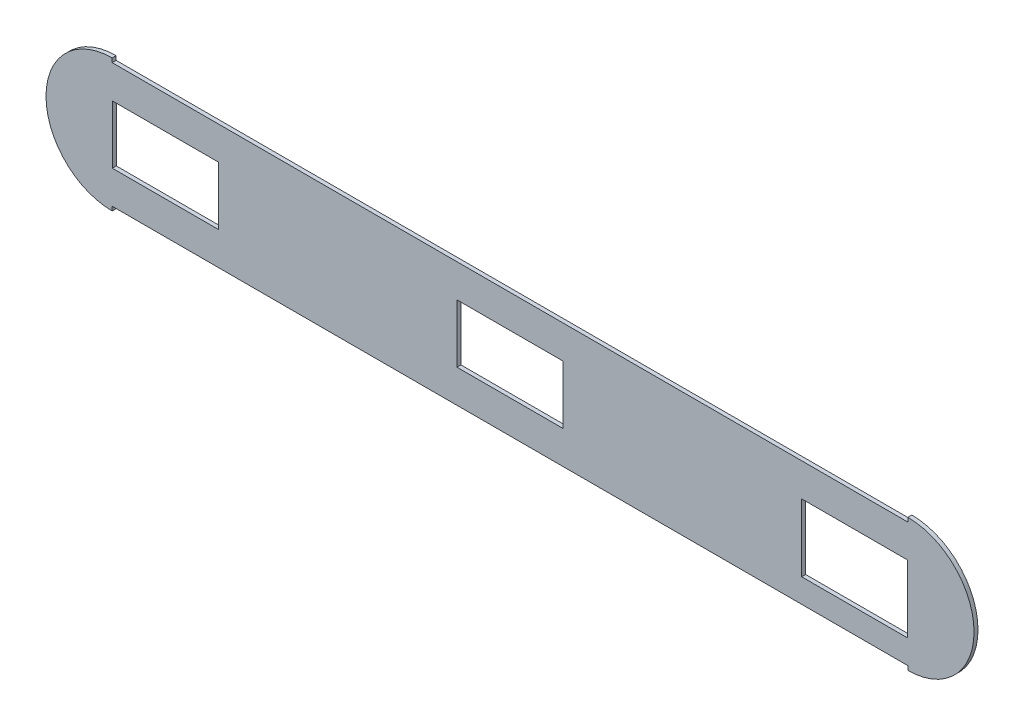
ISO-10303-21;
HEADER;
FILE_DESCRIPTION(('STEP AP214'),'2;1');
FILE_NAME('part.step','',(''),(''),'','','');
FILE_SCHEMA(('AUTOMOTIVE_DESIGN { 1 0 10303 214 1 1 1 1 }'));
ENDSEC;
DATA;
#1=APPLICATION_CONTEXT('core data for automotive mechanical design processes');
#2=APPLICATION_PROTOCOL_DEFINITION('international standard','automotive_design',2000,#1);
#3=PRODUCT_CONTEXT('',#1,'mechanical');
#4=PRODUCT('Part','Part','',(#3));
#5=PRODUCT_RELATED_PRODUCT_CATEGORY('part','',(#4));
#6=PRODUCT_DEFINITION_FORMATION('','',#4);
#7=PRODUCT_DEFINITION_CONTEXT('part definition',#1,'design');
#8=PRODUCT_DEFINITION('design','',#6,#7);
#9=PRODUCT_DEFINITION_SHAPE('','',#8);
#10=(LENGTH_UNIT() NAMED_UNIT(*) SI_UNIT(.MILLI.,.METRE.));
#11=(NAMED_UNIT(*) PLANE_ANGLE_UNIT() SI_UNIT($,.RADIAN.));
#12=(NAMED_UNIT(*) SI_UNIT($,.STERADIAN.) SOLID_ANGLE_UNIT());
#13=UNCERTAINTY_MEASURE_WITH_UNIT(LENGTH_MEASURE(1.E-05),#10,'distance_accuracy_value','');
#14=(GEOMETRIC_REPRESENTATION_CONTEXT(3) GLOBAL_UNCERTAINTY_ASSIGNED_CONTEXT((#13)) GLOBAL_UNIT_ASSIGNED_CONTEXT((#10,
#11,#12)) REPRESENTATION_CONTEXT('',''));
#15=CARTESIAN_POINT('',(0.,0.,0.));
#16=DIRECTION('',(0.,0.,1.));
#17=DIRECTION('',(1.,0.,0.));
#18=AXIS2_PLACEMENT_3D('',#15,#16,#17);
#19=CARTESIAN_POINT('',(-300.,0.,0.));
#20=DIRECTION('',(0.,0.,1.));
#21=DIRECTION('',(1.,0.,0.));
#22=AXIS2_PLACEMENT_3D('',#19,#20,#21);
#23=PLANE('',#22);
#24=DIRECTION('',(1.,0.,0.));
#25=VECTOR('',#24,1.);
#26=CARTESIAN_POINT('',(-300.,-28.9008568911611,0.));
#27=LINE('',#26,#25);
#28=CARTESIAN_POINT('',(220.,-28.900856891161,0.));
#29=VERTEX_POINT('',#28);
#30=CARTESIAN_POINT('',(300.,-28.900856891161,0.));
#31=VERTEX_POINT('',#30);
#32=EDGE_CURVE('E270',#29,#31,#27,.T.);
#33=ORIENTED_EDGE('',*,*,#32,.T.);
#34=DIRECTION('',(0.,1.,0.));
#35=VECTOR('',#34,1.);
#36=CARTESIAN_POINT('',(300.,0.,0.));
#37=LINE('',#36,#35);
#38=CARTESIAN_POINT('',(300.,22.,0.));
#39=VERTEX_POINT('',#38);
#40=EDGE_CURVE('E279',#31,#39,#37,.T.);
#41=ORIENTED_EDGE('',*,*,#40,.T.);
#42=DIRECTION('',(-1.,0.,0.));
#43=VECTOR('',#42,1.);
#44=CARTESIAN_POINT('',(-300.,22.,0.));
#45=LINE('',#44,#43);
#46=CARTESIAN_POINT('',(220.,22.,0.));
#47=VERTEX_POINT('',#46);
#48=EDGE_CURVE('E276',#39,#47,#45,.T.);
#49=ORIENTED_EDGE('',*,*,#48,.T.);
#50=DIRECTION('',(0.,-1.,0.));
#51=VECTOR('',#50,1.);
#52=CARTESIAN_POINT('',(220.,0.,0.));
#53=LINE('',#52,#51);
#54=EDGE_CURVE('E273',#47,#29,#53,.T.);
#55=ORIENTED_EDGE('',*,*,#54,.T.);
#56=EDGE_LOOP('',(#33,#41,#49,#55));
#57=FACE_BOUND('',#56,.T.);
#58=DIRECTION('',(-1.,0.,0.));
#59=VECTOR('',#58,1.);
#60=CARTESIAN_POINT('',(-300.,22.,0.));
#61=LINE('',#60,#59);
#62=CARTESIAN_POINT('',(-220.,22.,0.));
#63=VERTEX_POINT('',#62);
#64=CARTESIAN_POINT('',(-300.,22.,0.));
#65=VERTEX_POINT('',#64);
#66=EDGE_CURVE('E258',#63,#65,#61,.T.);
#67=ORIENTED_EDGE('',*,*,#66,.T.);
#68=DIRECTION('',(0.,-1.,0.));
#69=VECTOR('',#68,1.);
#70=CARTESIAN_POINT('',(-300.,0.,0.));
#71=LINE('',#70,#69);
#72=CARTESIAN_POINT('',(-300.,-22.,0.));
#73=VERTEX_POINT('',#72);
#74=EDGE_CURVE('E267',#65,#73,#71,.T.);
#75=ORIENTED_EDGE('',*,*,#74,.T.);
#76=DIRECTION('',(1.,0.,0.));
#77=VECTOR('',#76,1.);
#78=CARTESIAN_POINT('',(-300.,-22.,0.));
#79=LINE('',#78,#77);
#80=CARTESIAN_POINT('',(-220.,-22.0000000000001,0.));
#81=VERTEX_POINT('',#80);
#82=EDGE_CURVE('E264',#73,#81,#79,.T.);
#83=ORIENTED_EDGE('',*,*,#82,.T.);
#84=DIRECTION('',(0.,1.,0.));
#85=VECTOR('',#84,1.);
#86=CARTESIAN_POINT('',(-220.,0.,0.));
#87=LINE('',#86,#85);
#88=EDGE_CURVE('E261',#81,#63,#87,.T.);
#89=ORIENTED_EDGE('',*,*,#88,.T.);
#90=EDGE_LOOP('',(#67,#75,#83,#89));
#91=FACE_BOUND('',#90,.T.);
#92=DIRECTION('',(1.,0.,0.));
#93=VECTOR('',#92,1.);
#94=CARTESIAN_POINT('',(-300.,-22.,0.));
#95=LINE('',#94,#93);
#96=CARTESIAN_POINT('',(-40.0000000000001,-22.,0.));
#97=VERTEX_POINT('',#96);
#98=CARTESIAN_POINT('',(39.9999999999999,-22.,0.));
#99=VERTEX_POINT('',#98);
#100=EDGE_CURVE('E217',#97,#99,#95,.T.);
#101=ORIENTED_EDGE('',*,*,#100,.T.);
#102=DIRECTION('',(0.,1.,0.));
#103=VECTOR('',#102,1.);
#104=CARTESIAN_POINT('',(39.9999999999999,0.,0.));
#105=LINE('',#104,#103);
#106=CARTESIAN_POINT('',(39.9999999999999,22.,0.));
#107=VERTEX_POINT('',#106);
#108=EDGE_CURVE('E255',#99,#107,#105,.T.);
#109=ORIENTED_EDGE('',*,*,#108,.T.);
#110=DIRECTION('',(-1.,0.,0.));
#111=VECTOR('',#110,1.);
#112=CARTESIAN_POINT('',(-300.,22.,0.));
#113=LINE('',#112,#111);
#114=CARTESIAN_POINT('',(-40.0000000000001,22.,0.));
#115=VERTEX_POINT('',#114);
#116=EDGE_CURVE('E252',#107,#115,#113,.T.);
#117=ORIENTED_EDGE('',*,*,#116,.T.);
#118=DIRECTION('',(0.,-1.,0.));
#119=VECTOR('',#118,1.);
#120=CARTESIAN_POINT('',(-40.0000000000001,0.,0.));
#121=LINE('',#120,#119);
#122=EDGE_CURVE('E249',#115,#97,#121,.T.);
#123=ORIENTED_EDGE('',*,*,#122,.T.);
#124=EDGE_LOOP('',(#101,#109,#117,#123));
#125=FACE_BOUND('',#124,.T.);
#126=CARTESIAN_POINT('',(300.,0.,0.));
#127=DIRECTION('',(0.,0.,1.));
#128=DIRECTION('',(1.,0.,0.));
#129=AXIS2_PLACEMENT_3D('',#126,#127,#128);
#130=CIRCLE('',#129,50.);
#131=CARTESIAN_POINT('',(300.1,-49.9998999999,0.));
#132=VERTEX_POINT('',#131);
#133=CARTESIAN_POINT('',(300.1,49.9998999999,0.));
#134=VERTEX_POINT('',#133);
#135=EDGE_CURVE('E283',#132,#134,#130,.T.);
#136=ORIENTED_EDGE('',*,*,#135,.F.);
#137=DIRECTION('',(0.,1.,0.));
#138=VECTOR('',#137,1.);
#139=CARTESIAN_POINT('',(300.099999999999,1.04100755793368E-11,0.));
#140=LINE('',#139,#138);
#141=CARTESIAN_POINT('',(300.1,-46.9,0.));
#142=VERTEX_POINT('',#141);
#143=EDGE_CURVE('E46',#132,#142,#140,.T.);
#144=ORIENTED_EDGE('',*,*,#143,.T.);
#145=DIRECTION('',(-1.,0.,0.));
#146=VECTOR('',#145,1.);
#147=CARTESIAN_POINT('',(-300.,-46.9,0.));
#148=LINE('',#147,#146);
#149=CARTESIAN_POINT('',(-300.1,-46.9,0.));
#150=VERTEX_POINT('',#149);
#151=EDGE_CURVE('E210',#142,#150,#148,.T.);
#152=ORIENTED_EDGE('',*,*,#151,.T.);
#153=DIRECTION('',(0.,-1.,0.));
#154=VECTOR('',#153,1.);
#155=CARTESIAN_POINT('',(-300.1,0.,0.));
#156=LINE('',#155,#154);
#157=CARTESIAN_POINT('',(-300.1,-49.9998999999,0.));
#158=VERTEX_POINT('',#157);
#159=EDGE_CURVE('E205',#150,#158,#156,.T.);
#160=ORIENTED_EDGE('',*,*,#159,.T.);
#161=CARTESIAN_POINT('',(-300.,0.,0.));
#162=DIRECTION('',(0.,0.,1.));
#163=DIRECTION('',(1.,0.,0.));
#164=AXIS2_PLACEMENT_3D('',#161,#162,#163);
#165=CIRCLE('',#164,50.);
#166=CARTESIAN_POINT('',(-300.1,49.9998999999,0.));
#167=VERTEX_POINT('',#166);
#168=EDGE_CURVE('E287',#167,#158,#165,.T.);
#169=ORIENTED_EDGE('',*,*,#168,.F.);
#170=DIRECTION('',(0.,-1.,0.));
#171=VECTOR('',#170,1.);
#172=CARTESIAN_POINT('',(-300.1,0.,0.));
#173=LINE('',#172,#171);
#174=CARTESIAN_POINT('',(-300.1,46.9,0.));
#175=VERTEX_POINT('',#174);
#176=EDGE_CURVE('E200',#167,#175,#173,.T.);
#177=ORIENTED_EDGE('',*,*,#176,.T.);
#178=DIRECTION('',(1.,0.,0.));
#179=VECTOR('',#178,1.);
#180=CARTESIAN_POINT('',(-300.,46.9,0.));
#181=LINE('',#180,#179);
#182=CARTESIAN_POINT('',(300.1,46.9,0.));
#183=VERTEX_POINT('',#182);
#184=EDGE_CURVE('E208',#175,#183,#181,.T.);
#185=ORIENTED_EDGE('',*,*,#184,.T.);
#186=DIRECTION('',(0.,1.,0.));
#187=VECTOR('',#186,1.);
#188=CARTESIAN_POINT('',(300.100000000001,1.04100755793368E-11,0.));
#189=LINE('',#188,#187);
#190=EDGE_CURVE('E180',#183,#134,#189,.T.);
#191=ORIENTED_EDGE('',*,*,#190,.T.);
#192=EDGE_LOOP('',(#136,#144,#152,#160,#169,#177,#185,#191));
#193=FACE_BOUND('',#192,.T.);
#194=ADVANCED_FACE('F32',(#57,#91,#125,#193),#23,.F.);
#195=CARTESIAN_POINT('',(-300.,0.,3.));
#196=DIRECTION('',(0.,0.,1.));
#197=DIRECTION('',(1.,0.,0.));
#198=AXIS2_PLACEMENT_3D('',#195,#196,#197);
#199=PLANE('',#198);
#200=DIRECTION('',(0.,1.,0.));
#201=VECTOR('',#200,1.);
#202=CARTESIAN_POINT('',(300.099999999999,1.04100755793368E-11,3.));
#203=LINE('',#202,#201);
#204=CARTESIAN_POINT('',(300.1,-49.9998999999,3.));
#205=VERTEX_POINT('',#204);
#206=CARTESIAN_POINT('',(300.1,-46.9,3.));
#207=VERTEX_POINT('',#206);
#208=EDGE_CURVE('E191',#205,#207,#203,.T.);
#209=ORIENTED_EDGE('',*,*,#208,.F.);
#210=CARTESIAN_POINT('',(300.,0.,3.));
#211=DIRECTION('',(0.,0.,1.));
#212=DIRECTION('',(1.,0.,0.));
#213=AXIS2_PLACEMENT_3D('',#210,#211,#212);
#214=CIRCLE('',#213,50.);
#215=CARTESIAN_POINT('',(300.1,49.9998999999,3.));
#216=VERTEX_POINT('',#215);
#217=EDGE_CURVE('E188',#205,#216,#214,.T.);
#218=ORIENTED_EDGE('',*,*,#217,.T.);
#219=DIRECTION('',(0.,1.,0.));
#220=VECTOR('',#219,1.);
#221=CARTESIAN_POINT('',(300.100000000001,1.04100755793368E-11,3.));
#222=LINE('',#221,#220);
#223=CARTESIAN_POINT('',(300.1,46.9,3.));
#224=VERTEX_POINT('',#223);
#225=EDGE_CURVE('E54',#224,#216,#222,.T.);
#226=ORIENTED_EDGE('',*,*,#225,.F.);
#227=DIRECTION('',(1.,0.,0.));
#228=VECTOR('',#227,1.);
#229=CARTESIAN_POINT('',(-300.,46.9,3.));
#230=LINE('',#229,#228);
#231=CARTESIAN_POINT('',(-300.1,46.9,3.));
#232=VERTEX_POINT('',#231);
#233=EDGE_CURVE('E39',#232,#224,#230,.T.);
#234=ORIENTED_EDGE('',*,*,#233,.F.);
#235=DIRECTION('',(0.,-1.,0.));
#236=VECTOR('',#235,1.);
#237=CARTESIAN_POINT('',(-300.1,0.,3.));
#238=LINE('',#237,#236);
#239=CARTESIAN_POINT('',(-300.1,49.9998999999,3.));
#240=VERTEX_POINT('',#239);
#241=EDGE_CURVE('E198',#240,#232,#238,.T.);
#242=ORIENTED_EDGE('',*,*,#241,.F.);
#243=CARTESIAN_POINT('',(-300.,0.,3.));
#244=DIRECTION('',(0.,0.,1.));
#245=DIRECTION('',(1.,0.,0.));
#246=AXIS2_PLACEMENT_3D('',#243,#244,#245);
#247=CIRCLE('',#246,50.);
#248=CARTESIAN_POINT('',(-300.1,-49.9998999999,3.));
#249=VERTEX_POINT('',#248);
#250=EDGE_CURVE('E286',#240,#249,#247,.T.);
#251=ORIENTED_EDGE('',*,*,#250,.T.);
#252=DIRECTION('',(0.,-1.,0.));
#253=VECTOR('',#252,1.);
#254=CARTESIAN_POINT('',(-300.1,0.,3.));
#255=LINE('',#254,#253);
#256=CARTESIAN_POINT('',(-300.1,-46.9,3.));
#257=VERTEX_POINT('',#256);
#258=EDGE_CURVE('E203',#257,#249,#255,.T.);
#259=ORIENTED_EDGE('',*,*,#258,.F.);
#260=DIRECTION('',(-1.,0.,0.));
#261=VECTOR('',#260,1.);
#262=CARTESIAN_POINT('',(-300.,-46.9,3.));
#263=LINE('',#262,#261);
#264=EDGE_CURVE('E11',#207,#257,#263,.T.);
#265=ORIENTED_EDGE('',*,*,#264,.F.);
#266=EDGE_LOOP('',(#209,#218,#226,#234,#242,#251,#259,#265));
#267=FACE_BOUND('',#266,.T.);
#268=DIRECTION('',(0.,1.,0.));
#269=VECTOR('',#268,1.);
#270=CARTESIAN_POINT('',(300.,0.,3.));
#271=LINE('',#270,#269);
#272=CARTESIAN_POINT('',(300.,-28.900856891161,3.));
#273=VERTEX_POINT('',#272);
#274=CARTESIAN_POINT('',(300.,22.,3.));
#275=VERTEX_POINT('',#274);
#276=EDGE_CURVE('E317',#273,#275,#271,.T.);
#277=ORIENTED_EDGE('',*,*,#276,.F.);
#278=DIRECTION('',(1.,0.,0.));
#279=VECTOR('',#278,1.);
#280=CARTESIAN_POINT('',(-300.,-28.9008568911611,3.));
#281=LINE('',#280,#279);
#282=CARTESIAN_POINT('',(220.,-28.900856891161,3.));
#283=VERTEX_POINT('',#282);
#284=EDGE_CURVE('E310',#283,#273,#281,.T.);
#285=ORIENTED_EDGE('',*,*,#284,.F.);
#286=DIRECTION('',(0.,-1.,0.));
#287=VECTOR('',#286,1.);
#288=CARTESIAN_POINT('',(220.,0.,3.));
#289=LINE('',#288,#287);
#290=CARTESIAN_POINT('',(220.,22.,3.));
#291=VERTEX_POINT('',#290);
#292=EDGE_CURVE('E312',#291,#283,#289,.T.);
#293=ORIENTED_EDGE('',*,*,#292,.F.);
#294=DIRECTION('',(-1.,0.,0.));
#295=VECTOR('',#294,1.);
#296=CARTESIAN_POINT('',(-300.,22.,3.));
#297=LINE('',#296,#295);
#298=EDGE_CURVE('E315',#275,#291,#297,.T.);
#299=ORIENTED_EDGE('',*,*,#298,.F.);
#300=EDGE_LOOP('',(#277,#285,#293,#299));
#301=FACE_BOUND('',#300,.T.);
#302=DIRECTION('',(0.,-1.,0.));
#303=VECTOR('',#302,1.);
#304=CARTESIAN_POINT('',(-300.,0.,3.));
#305=LINE('',#304,#303);
#306=CARTESIAN_POINT('',(-300.,22.,3.));
#307=VERTEX_POINT('',#306);
#308=CARTESIAN_POINT('',(-300.,-22.,3.));
#309=VERTEX_POINT('',#308);
#310=EDGE_CURVE('E308',#307,#309,#305,.T.);
#311=ORIENTED_EDGE('',*,*,#310,.F.);
#312=DIRECTION('',(-1.,0.,0.));
#313=VECTOR('',#312,1.);
#314=CARTESIAN_POINT('',(-300.,22.,3.));
#315=LINE('',#314,#313);
#316=CARTESIAN_POINT('',(-220.,22.,3.));
#317=VERTEX_POINT('',#316);
#318=EDGE_CURVE('E301',#317,#307,#315,.T.);
#319=ORIENTED_EDGE('',*,*,#318,.F.);
#320=DIRECTION('',(0.,1.,0.));
#321=VECTOR('',#320,1.);
#322=CARTESIAN_POINT('',(-220.,0.,3.));
#323=LINE('',#322,#321);
#324=CARTESIAN_POINT('',(-220.,-22.0000000000001,3.));
#325=VERTEX_POINT('',#324);
#326=EDGE_CURVE('E303',#325,#317,#323,.T.);
#327=ORIENTED_EDGE('',*,*,#326,.F.);
#328=DIRECTION('',(1.,0.,0.));
#329=VECTOR('',#328,1.);
#330=CARTESIAN_POINT('',(-300.,-22.,3.));
#331=LINE('',#330,#329);
#332=EDGE_CURVE('E306',#309,#325,#331,.T.);
#333=ORIENTED_EDGE('',*,*,#332,.F.);
#334=EDGE_LOOP('',(#311,#319,#327,#333));
#335=FACE_BOUND('',#334,.T.);
#336=DIRECTION('',(0.,1.,0.));
#337=VECTOR('',#336,1.);
#338=CARTESIAN_POINT('',(39.9999999999999,0.,3.));
#339=LINE('',#338,#337);
#340=CARTESIAN_POINT('',(39.9999999999999,-22.,3.));
#341=VERTEX_POINT('',#340);
#342=CARTESIAN_POINT('',(39.9999999999999,22.,3.));
#343=VERTEX_POINT('',#342);
#344=EDGE_CURVE('E299',#341,#343,#339,.T.);
#345=ORIENTED_EDGE('',*,*,#344,.F.);
#346=DIRECTION('',(1.,0.,0.));
#347=VECTOR('',#346,1.);
#348=CARTESIAN_POINT('',(-300.,-22.,3.));
#349=LINE('',#348,#347);
#350=CARTESIAN_POINT('',(-40.0000000000001,-22.,3.));
#351=VERTEX_POINT('',#350);
#352=EDGE_CURVE('E290',#351,#341,#349,.T.);
#353=ORIENTED_EDGE('',*,*,#352,.F.);
#354=DIRECTION('',(0.,-1.,0.));
#355=VECTOR('',#354,1.);
#356=CARTESIAN_POINT('',(-40.0000000000001,0.,3.));
#357=LINE('',#356,#355);
#358=CARTESIAN_POINT('',(-40.0000000000001,22.,3.));
#359=VERTEX_POINT('',#358);
#360=EDGE_CURVE('E294',#359,#351,#357,.T.);
#361=ORIENTED_EDGE('',*,*,#360,.F.);
#362=DIRECTION('',(-1.,0.,0.));
#363=VECTOR('',#362,1.);
#364=CARTESIAN_POINT('',(-300.,22.,3.));
#365=LINE('',#364,#363);
#366=EDGE_CURVE('E297',#343,#359,#365,.T.);
#367=ORIENTED_EDGE('',*,*,#366,.F.);
#368=EDGE_LOOP('',(#345,#353,#361,#367));
#369=FACE_BOUND('',#368,.T.);
#370=ADVANCED_FACE('F185',(#267,#301,#335,#369),#199,.T.);
#371=CARTESIAN_POINT('',(-300.,0.,60.));
#372=DIRECTION('',(0.,0.,-1.));
#373=DIRECTION('',(-1.,0.,0.));
#374=AXIS2_PLACEMENT_3D('',#371,#372,#373);
#375=CYLINDRICAL_SURFACE('',#374,50.);
#376=ORIENTED_EDGE('',*,*,#168,.T.);
#377=DIRECTION('',(0.,0.,-1.));
#378=VECTOR('',#377,1.);
#379=CARTESIAN_POINT('',(-300.1,-49.9998999999,60.));
#380=LINE('',#379,#378);
#381=EDGE_CURVE('E177',#158,#249,#380,.F.);
#382=ORIENTED_EDGE('',*,*,#381,.T.);
#383=ORIENTED_EDGE('',*,*,#250,.F.);
#384=DIRECTION('',(0.,0.,-1.));
#385=VECTOR('',#384,1.);
#386=CARTESIAN_POINT('',(-300.1,49.9998999999,60.));
#387=LINE('',#386,#385);
#388=EDGE_CURVE('E323',#240,#167,#387,.T.);
#389=ORIENTED_EDGE('',*,*,#388,.T.);
#390=EDGE_LOOP('',(#376,#382,#383,#389));
#391=FACE_BOUND('',#390,.T.);
#392=ADVANCED_FACE('F329',(#391),#375,.T.);
#393=CARTESIAN_POINT('',(300.,0.,60.));
#394=DIRECTION('',(0.,0.,-1.));
#395=DIRECTION('',(-1.,0.,0.));
#396=AXIS2_PLACEMENT_3D('',#393,#394,#395);
#397=CYLINDRICAL_SURFACE('',#396,50.);
#398=ORIENTED_EDGE('',*,*,#217,.F.);
#399=DIRECTION('',(0.,0.,-1.));
#400=VECTOR('',#399,1.);
#401=CARTESIAN_POINT('',(300.1,-49.9998999999,60.));
#402=LINE('',#401,#400);
#403=EDGE_CURVE('E321',#205,#132,#402,.T.);
#404=ORIENTED_EDGE('',*,*,#403,.T.);
#405=ORIENTED_EDGE('',*,*,#135,.T.);
#406=DIRECTION('',(0.,0.,-1.));
#407=VECTOR('',#406,1.);
#408=CARTESIAN_POINT('',(300.1,49.9998999999,60.));
#409=LINE('',#408,#407);
#410=EDGE_CURVE('E319',#134,#216,#409,.F.);
#411=ORIENTED_EDGE('',*,*,#410,.T.);
#412=EDGE_LOOP('',(#398,#404,#405,#411));
#413=FACE_BOUND('',#412,.T.);
#414=ADVANCED_FACE('F346',(#413),#397,.T.);
#415=CARTESIAN_POINT('',(39.9999999999999,22.,60.));
#416=DIRECTION('',(1.,0.,0.));
#417=DIRECTION('',(0.,1.,0.));
#418=AXIS2_PLACEMENT_3D('',#415,#416,#417);
#419=PLANE('',#418);
#420=DIRECTION('',(0.,0.,-1.));
#421=VECTOR('',#420,1.);
#422=CARTESIAN_POINT('',(39.9999999999999,-22.,60.));
#423=LINE('',#422,#421);
#424=EDGE_CURVE('E213',#341,#99,#423,.T.);
#425=ORIENTED_EDGE('',*,*,#424,.F.);
#426=ORIENTED_EDGE('',*,*,#344,.T.);
#427=DIRECTION('',(0.,0.,-1.));
#428=VECTOR('',#427,1.);
#429=CARTESIAN_POINT('',(39.9999999999999,22.,60.));
#430=LINE('',#429,#428);
#431=EDGE_CURVE('E237',#343,#107,#430,.T.);
#432=ORIENTED_EDGE('',*,*,#431,.T.);
#433=ORIENTED_EDGE('',*,*,#108,.F.);
#434=EDGE_LOOP('',(#425,#426,#432,#433));
#435=FACE_BOUND('',#434,.T.);
#436=ADVANCED_FACE('F375',(#435),#419,.F.);
#437=CARTESIAN_POINT('',(39.9999999999999,22.,60.));
#438=DIRECTION('',(0.,1.,0.));
#439=DIRECTION('',(0.,0.,1.));
#440=AXIS2_PLACEMENT_3D('',#437,#438,#439);
#441=PLANE('',#440);
#442=ORIENTED_EDGE('',*,*,#431,.F.);
#443=ORIENTED_EDGE('',*,*,#366,.T.);
#444=DIRECTION('',(0.,0.,-1.));
#445=VECTOR('',#444,1.);
#446=CARTESIAN_POINT('',(-40.0000000000001,22.,60.));
#447=LINE('',#446,#445);
#448=EDGE_CURVE('E240',#359,#115,#447,.T.);
#449=ORIENTED_EDGE('',*,*,#448,.T.);
#450=ORIENTED_EDGE('',*,*,#116,.F.);
#451=EDGE_LOOP('',(#442,#443,#449,#450));
#452=FACE_BOUND('',#451,.T.);
#453=ADVANCED_FACE('F378',(#452),#441,.F.);
#454=CARTESIAN_POINT('',(-40.0000000000001,22.,60.));
#455=DIRECTION('',(-1.,0.,0.));
#456=DIRECTION('',(0.,-1.,0.));
#457=AXIS2_PLACEMENT_3D('',#454,#455,#456);
#458=PLANE('',#457);
#459=ORIENTED_EDGE('',*,*,#448,.F.);
#460=ORIENTED_EDGE('',*,*,#360,.T.);
#461=DIRECTION('',(0.,0.,-1.));
#462=VECTOR('',#461,1.);
#463=CARTESIAN_POINT('',(-40.0000000000001,-22.,60.));
#464=LINE('',#463,#462);
#465=EDGE_CURVE('E243',#351,#97,#464,.T.);
#466=ORIENTED_EDGE('',*,*,#465,.T.);
#467=ORIENTED_EDGE('',*,*,#122,.F.);
#468=EDGE_LOOP('',(#459,#460,#466,#467));
#469=FACE_BOUND('',#468,.T.);
#470=ADVANCED_FACE('F368',(#469),#458,.F.);
#471=CARTESIAN_POINT('',(39.9999999999999,-22.,60.));
#472=DIRECTION('',(0.,-1.,0.));
#473=DIRECTION('',(0.,0.,-1.));
#474=AXIS2_PLACEMENT_3D('',#471,#472,#473);
#475=PLANE('',#474);
#476=ORIENTED_EDGE('',*,*,#465,.F.);
#477=ORIENTED_EDGE('',*,*,#352,.T.);
#478=ORIENTED_EDGE('',*,*,#424,.T.);
#479=ORIENTED_EDGE('',*,*,#100,.F.);
#480=EDGE_LOOP('',(#476,#477,#478,#479));
#481=FACE_BOUND('',#480,.T.);
#482=ADVANCED_FACE('F364',(#481),#475,.F.);
#483=CARTESIAN_POINT('',(-300.,-22.,60.));
#484=DIRECTION('',(-1.,0.,0.));
#485=DIRECTION('',(0.,0.,1.));
#486=AXIS2_PLACEMENT_3D('',#483,#484,#485);
#487=PLANE('',#486);
#488=DIRECTION('',(0.,0.,-1.));
#489=VECTOR('',#488,1.);
#490=CARTESIAN_POINT('',(-300.,22.,60.));
#491=LINE('',#490,#489);
#492=EDGE_CURVE('E235',#307,#65,#491,.T.);
#493=ORIENTED_EDGE('',*,*,#492,.F.);
#494=ORIENTED_EDGE('',*,*,#310,.T.);
#495=DIRECTION('',(0.,0.,-1.));
#496=VECTOR('',#495,1.);
#497=CARTESIAN_POINT('',(-300.,-22.,60.));
#498=LINE('',#497,#496);
#499=EDGE_CURVE('E226',#309,#73,#498,.T.);
#500=ORIENTED_EDGE('',*,*,#499,.T.);
#501=ORIENTED_EDGE('',*,*,#74,.F.);
#502=EDGE_LOOP('',(#493,#494,#500,#501));
#503=FACE_BOUND('',#502,.T.);
#504=ADVANCED_FACE('F388',(#503),#487,.F.);
#505=CARTESIAN_POINT('',(-300.,-22.,60.));
#506=DIRECTION('',(0.,-1.,0.));
#507=DIRECTION('',(1.,0.,0.));
#508=AXIS2_PLACEMENT_3D('',#505,#506,#507);
#509=PLANE('',#508);
#510=ORIENTED_EDGE('',*,*,#499,.F.);
#511=ORIENTED_EDGE('',*,*,#332,.T.);
#512=DIRECTION('',(0.,0.,-1.));
#513=VECTOR('',#512,1.);
#514=CARTESIAN_POINT('',(-220.,-22.0000000000001,60.));
#515=LINE('',#514,#513);
#516=EDGE_CURVE('E229',#325,#81,#515,.T.);
#517=ORIENTED_EDGE('',*,*,#516,.T.);
#518=ORIENTED_EDGE('',*,*,#82,.F.);
#519=EDGE_LOOP('',(#510,#511,#517,#518));
#520=FACE_BOUND('',#519,.T.);
#521=ADVANCED_FACE('F437',(#520),#509,.F.);
#522=CARTESIAN_POINT('',(-220.,-22.0000000000001,60.));
#523=DIRECTION('',(1.,0.,0.));
#524=DIRECTION('',(0.,0.,-1.));
#525=AXIS2_PLACEMENT_3D('',#522,#523,#524);
#526=PLANE('',#525);
#527=ORIENTED_EDGE('',*,*,#516,.F.);
#528=ORIENTED_EDGE('',*,*,#326,.T.);
#529=DIRECTION('',(0.,0.,-1.));
#530=VECTOR('',#529,1.);
#531=CARTESIAN_POINT('',(-220.,22.,60.));
#532=LINE('',#531,#530);
#533=EDGE_CURVE('E232',#317,#63,#532,.T.);
#534=ORIENTED_EDGE('',*,*,#533,.T.);
#535=ORIENTED_EDGE('',*,*,#88,.F.);
#536=EDGE_LOOP('',(#527,#528,#534,#535));
#537=FACE_BOUND('',#536,.T.);
#538=ADVANCED_FACE('F447',(#537),#526,.F.);
#539=CARTESIAN_POINT('',(-300.,22.,60.));
#540=DIRECTION('',(0.,1.,0.));
#541=DIRECTION('',(-1.,0.,0.));
#542=AXIS2_PLACEMENT_3D('',#539,#540,#541);
#543=PLANE('',#542);
#544=ORIENTED_EDGE('',*,*,#533,.F.);
#545=ORIENTED_EDGE('',*,*,#318,.T.);
#546=ORIENTED_EDGE('',*,*,#492,.T.);
#547=ORIENTED_EDGE('',*,*,#66,.F.);
#548=EDGE_LOOP('',(#544,#545,#546,#547));
#549=FACE_BOUND('',#548,.T.);
#550=ADVANCED_FACE('F458',(#549),#543,.F.);
#551=CARTESIAN_POINT('',(300.,-28.900856891161,60.));
#552=DIRECTION('',(1.,0.,0.));
#553=DIRECTION('',(0.,0.,-1.));
#554=AXIS2_PLACEMENT_3D('',#551,#552,#553);
#555=PLANE('',#554);
#556=DIRECTION('',(0.,0.,-1.));
#557=VECTOR('',#556,1.);
#558=CARTESIAN_POINT('',(300.,-28.900856891161,60.));
#559=LINE('',#558,#557);
#560=EDGE_CURVE('E224',#273,#31,#559,.T.);
#561=ORIENTED_EDGE('',*,*,#560,.F.);
#562=ORIENTED_EDGE('',*,*,#276,.T.);
#563=DIRECTION('',(0.,0.,-1.));
#564=VECTOR('',#563,1.);
#565=CARTESIAN_POINT('',(300.,22.,60.));
#566=LINE('',#565,#564);
#567=EDGE_CURVE('E214',#275,#39,#566,.T.);
#568=ORIENTED_EDGE('',*,*,#567,.T.);
#569=ORIENTED_EDGE('',*,*,#40,.F.);
#570=EDGE_LOOP('',(#561,#562,#568,#569));
#571=FACE_BOUND('',#570,.T.);
#572=ADVANCED_FACE('F467',(#571),#555,.F.);
#573=CARTESIAN_POINT('',(300.,22.,60.));
#574=DIRECTION('',(0.,1.,0.));
#575=DIRECTION('',(0.,0.,1.));
#576=AXIS2_PLACEMENT_3D('',#573,#574,#575);
#577=PLANE('',#576);
#578=ORIENTED_EDGE('',*,*,#567,.F.);
#579=ORIENTED_EDGE('',*,*,#298,.T.);
#580=DIRECTION('',(0.,0.,-1.));
#581=VECTOR('',#580,1.);
#582=CARTESIAN_POINT('',(220.,22.,60.));
#583=LINE('',#582,#581);
#584=EDGE_CURVE('E218',#291,#47,#583,.T.);
#585=ORIENTED_EDGE('',*,*,#584,.T.);
#586=ORIENTED_EDGE('',*,*,#48,.F.);
#587=EDGE_LOOP('',(#578,#579,#585,#586));
#588=FACE_BOUND('',#587,.T.);
#589=ADVANCED_FACE('F475',(#588),#577,.F.);
#590=CARTESIAN_POINT('',(220.,-28.900856891161,60.));
#591=DIRECTION('',(-1.,0.,0.));
#592=DIRECTION('',(0.,0.,1.));
#593=AXIS2_PLACEMENT_3D('',#590,#591,#592);
#594=PLANE('',#593);
#595=ORIENTED_EDGE('',*,*,#584,.F.);
#596=ORIENTED_EDGE('',*,*,#292,.T.);
#597=DIRECTION('',(0.,0.,-1.));
#598=VECTOR('',#597,1.);
#599=CARTESIAN_POINT('',(220.,-28.900856891161,60.));
#600=LINE('',#599,#598);
#601=EDGE_CURVE('E221',#283,#29,#600,.T.);
#602=ORIENTED_EDGE('',*,*,#601,.T.);
#603=ORIENTED_EDGE('',*,*,#54,.F.);
#604=EDGE_LOOP('',(#595,#596,#602,#603));
#605=FACE_BOUND('',#604,.T.);
#606=ADVANCED_FACE('F486',(#605),#594,.F.);
#607=CARTESIAN_POINT('',(300.,-28.900856891161,60.));
#608=DIRECTION('',(0.,-1.,0.));
#609=DIRECTION('',(1.,0.,0.));
#610=AXIS2_PLACEMENT_3D('',#607,#608,#609);
#611=PLANE('',#610);
#612=ORIENTED_EDGE('',*,*,#601,.F.);
#613=ORIENTED_EDGE('',*,*,#284,.T.);
#614=ORIENTED_EDGE('',*,*,#560,.T.);
#615=ORIENTED_EDGE('',*,*,#32,.F.);
#616=EDGE_LOOP('',(#612,#613,#614,#615));
#617=FACE_BOUND('',#616,.T.);
#618=ADVANCED_FACE('F497',(#617),#611,.F.);
#619=CARTESIAN_POINT('',(300.1,46.9,60.));
#620=DIRECTION('',(0.,-1.,0.));
#621=DIRECTION('',(0.,0.,-1.));
#622=AXIS2_PLACEMENT_3D('',#619,#620,#621);
#623=PLANE('',#622);
#624=DIRECTION('',(0.,0.,-1.));
#625=VECTOR('',#624,1.);
#626=CARTESIAN_POINT('',(-300.1,46.9,60.));
#627=LINE('',#626,#625);
#628=EDGE_CURVE('E174',#232,#175,#627,.T.);
#629=ORIENTED_EDGE('',*,*,#628,.F.);
#630=ORIENTED_EDGE('',*,*,#233,.T.);
#631=DIRECTION('',(0.,0.,-1.));
#632=VECTOR('',#631,1.);
#633=CARTESIAN_POINT('',(300.1,46.9,60.));
#634=LINE('',#633,#632);
#635=EDGE_CURVE('E171',#224,#183,#634,.T.);
#636=ORIENTED_EDGE('',*,*,#635,.T.);
#637=ORIENTED_EDGE('',*,*,#184,.F.);
#638=EDGE_LOOP('',(#629,#630,#636,#637));
#639=FACE_BOUND('',#638,.T.);
#640=ADVANCED_FACE('F170',(#639),#623,.F.);
#641=CARTESIAN_POINT('',(-300.1,46.9,60.));
#642=DIRECTION('',(-1.,0.,0.));
#643=DIRECTION('',(0.,0.,1.));
#644=AXIS2_PLACEMENT_3D('',#641,#642,#643);
#645=PLANE('',#644);
#646=ORIENTED_EDGE('',*,*,#388,.F.);
#647=ORIENTED_EDGE('',*,*,#241,.T.);
#648=ORIENTED_EDGE('',*,*,#628,.T.);
#649=ORIENTED_EDGE('',*,*,#176,.F.);
#650=EDGE_LOOP('',(#646,#647,#648,#649));
#651=FACE_BOUND('',#650,.T.);
#652=ADVANCED_FACE('F335',(#651),#645,.F.);
#653=CARTESIAN_POINT('',(300.1,50.1,60.));
#654=DIRECTION('',(1.,0.,0.));
#655=DIRECTION('',(0.,1.,0.));
#656=AXIS2_PLACEMENT_3D('',#653,#654,#655);
#657=PLANE('',#656);
#658=ORIENTED_EDGE('',*,*,#635,.F.);
#659=ORIENTED_EDGE('',*,*,#225,.T.);
#660=ORIENTED_EDGE('',*,*,#410,.F.);
#661=ORIENTED_EDGE('',*,*,#190,.F.);
#662=EDGE_LOOP('',(#658,#659,#660,#661));
#663=FACE_BOUND('',#662,.T.);
#664=ADVANCED_FACE('F178',(#663),#657,.F.);
#665=CARTESIAN_POINT('',(-300.1,-46.9,60.));
#666=DIRECTION('',(0.,1.,0.));
#667=DIRECTION('',(0.,0.,1.));
#668=AXIS2_PLACEMENT_3D('',#665,#666,#667);
#669=PLANE('',#668);
#670=DIRECTION('',(0.,0.,-1.));
#671=VECTOR('',#670,1.);
#672=CARTESIAN_POINT('',(300.1,-46.9,60.));
#673=LINE('',#672,#671);
#674=EDGE_CURVE('E189',#207,#142,#673,.T.);
#675=ORIENTED_EDGE('',*,*,#674,.F.);
#676=ORIENTED_EDGE('',*,*,#264,.T.);
#677=DIRECTION('',(0.,0.,-1.));
#678=VECTOR('',#677,1.);
#679=CARTESIAN_POINT('',(-300.1,-46.9,60.));
#680=LINE('',#679,#678);
#681=EDGE_CURVE('E181',#257,#150,#680,.T.);
#682=ORIENTED_EDGE('',*,*,#681,.T.);
#683=ORIENTED_EDGE('',*,*,#151,.F.);
#684=EDGE_LOOP('',(#675,#676,#682,#683));
#685=FACE_BOUND('',#684,.T.);
#686=ADVANCED_FACE('F343',(#685),#669,.F.);
#687=CARTESIAN_POINT('',(-300.1,-50.1,60.));
#688=DIRECTION('',(-1.,0.,0.));
#689=DIRECTION('',(0.,0.,1.));
#690=AXIS2_PLACEMENT_3D('',#687,#688,#689);
#691=PLANE('',#690);
#692=ORIENTED_EDGE('',*,*,#681,.F.);
#693=ORIENTED_EDGE('',*,*,#258,.T.);
#694=ORIENTED_EDGE('',*,*,#381,.F.);
#695=ORIENTED_EDGE('',*,*,#159,.F.);
#696=EDGE_LOOP('',(#692,#693,#694,#695));
#697=FACE_BOUND('',#696,.T.);
#698=ADVANCED_FACE('F340',(#697),#691,.F.);
#699=CARTESIAN_POINT('',(300.1,-46.9,60.));
#700=DIRECTION('',(1.,0.,0.));
#701=DIRECTION('',(0.,1.,0.));
#702=AXIS2_PLACEMENT_3D('',#699,#700,#701);
#703=PLANE('',#702);
#704=ORIENTED_EDGE('',*,*,#403,.F.);
#705=ORIENTED_EDGE('',*,*,#208,.T.);
#706=ORIENTED_EDGE('',*,*,#674,.T.);
#707=ORIENTED_EDGE('',*,*,#143,.F.);
#708=EDGE_LOOP('',(#704,#705,#706,#707));
#709=FACE_BOUND('',#708,.T.);
#710=ADVANCED_FACE('F347',(#709),#703,.F.);
#711=CLOSED_SHELL('',(#194,#370,#392,#414,#436,#453,#470,#482,#504,#521,#538,#550,#572,#589,
#606,#618,#640,#652,#664,#686,#698,#710));
#712=MANIFOLD_SOLID_BREP('B2',#711);
#713=ADVANCED_BREP_SHAPE_REPRESENTATION('',(#18,#712),#14);
#714=SHAPE_DEFINITION_REPRESENTATION(#9,#713);
ENDSEC;
END-ISO-10303-21;
